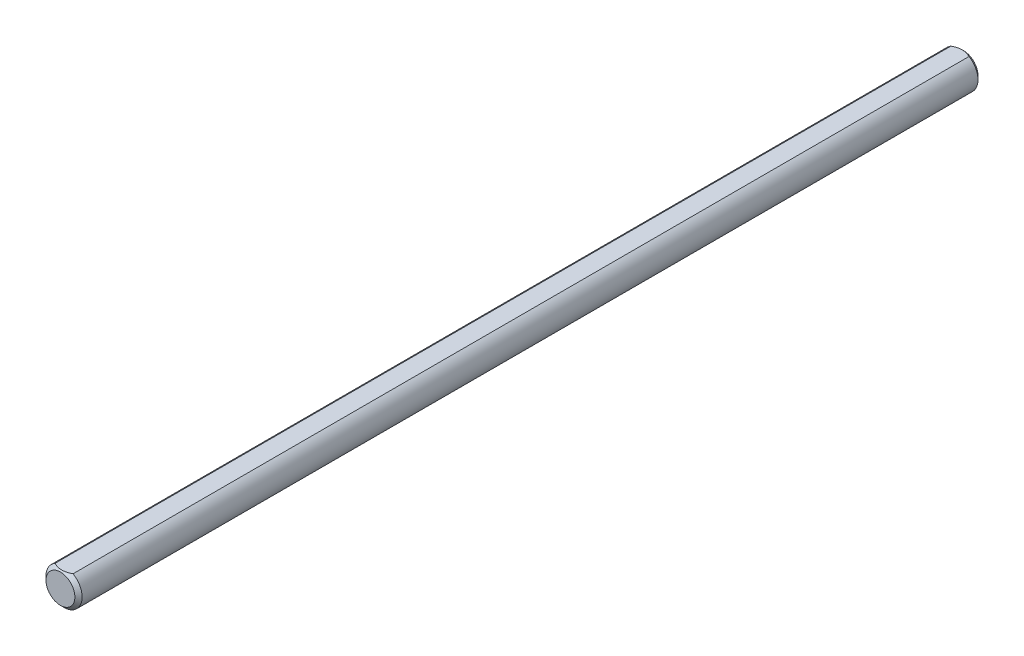
ISO-10303-21;
HEADER;
FILE_DESCRIPTION(('STEP AP214'),'2;1');
FILE_NAME('part.step','',(''),(''),'','','');
FILE_SCHEMA(('AUTOMOTIVE_DESIGN { 1 0 10303 214 1 1 1 1 }'));
ENDSEC;
DATA;
#1=APPLICATION_CONTEXT('core data for automotive mechanical design processes');
#2=APPLICATION_PROTOCOL_DEFINITION('international standard','automotive_design',2000,#1);
#3=PRODUCT_CONTEXT('',#1,'mechanical');
#4=PRODUCT('Part','Part','',(#3));
#5=PRODUCT_RELATED_PRODUCT_CATEGORY('part','',(#4));
#6=PRODUCT_DEFINITION_FORMATION('','',#4);
#7=PRODUCT_DEFINITION_CONTEXT('part definition',#1,'design');
#8=PRODUCT_DEFINITION('design','',#6,#7);
#9=PRODUCT_DEFINITION_SHAPE('','',#8);
#10=(LENGTH_UNIT() NAMED_UNIT(*) SI_UNIT(.MILLI.,.METRE.));
#11=(NAMED_UNIT(*) PLANE_ANGLE_UNIT() SI_UNIT($,.RADIAN.));
#12=(NAMED_UNIT(*) SI_UNIT($,.STERADIAN.) SOLID_ANGLE_UNIT());
#13=UNCERTAINTY_MEASURE_WITH_UNIT(LENGTH_MEASURE(1.E-05),#10,'distance_accuracy_value','');
#14=(GEOMETRIC_REPRESENTATION_CONTEXT(3) GLOBAL_UNCERTAINTY_ASSIGNED_CONTEXT((#13)) GLOBAL_UNIT_ASSIGNED_CONTEXT((#10,
#11,#12)) REPRESENTATION_CONTEXT('',''));
#15=CARTESIAN_POINT('',(0.,0.,0.));
#16=DIRECTION('',(0.,0.,1.));
#17=DIRECTION('',(1.,0.,0.));
#18=AXIS2_PLACEMENT_3D('',#15,#16,#17);
#19=CARTESIAN_POINT('',(0.,0.,79.375));
#20=DIRECTION('',(0.,0.,-1.00000000000002));
#21=DIRECTION('',(-1.,0.,0.));
#22=AXIS2_PLACEMENT_3D('',#19,#20,#21);
#23=CYLINDRICAL_SURFACE('',#22,3.175);
#24=CARTESIAN_POINT('',(0.,-1.52655665885959E-13,78.7400000000001));
#25=DIRECTION('',(0.,0.,1.00000000000002));
#26=DIRECTION('',(1.,0.,0.));
#27=AXIS2_PLACEMENT_3D('',#24,#25,#26);
#28=CIRCLE('',#27,3.175);
#29=CARTESIAN_POINT('',(1.58749999999999,2.7496306570157,78.7400000000002));
#30=VERTEX_POINT('',#29);
#31=CARTESIAN_POINT('',(-1.58750000000006,2.74963065701568,78.7400000000001));
#32=VERTEX_POINT('',#31);
#33=EDGE_CURVE('E75',#30,#32,#28,.F.);
#34=ORIENTED_EDGE('',*,*,#33,.T.);
#35=DIRECTION('',(0.,0.,1.00000000000002));
#36=VECTOR('',#35,1.);
#37=CARTESIAN_POINT('',(-1.5875000000003,2.74963065701568,-79.3750000000017));
#38=LINE('',#37,#36);
#39=CARTESIAN_POINT('',(-1.58750000000013,2.74963065701566,-78.7400000000014));
#40=VERTEX_POINT('',#39);
#41=EDGE_CURVE('E53',#40,#32,#38,.T.);
#42=ORIENTED_EDGE('',*,*,#41,.F.);
#43=CARTESIAN_POINT('',(-2.22044604925031E-13,-1.31838984174237E-13,-78.7400000000021));
#44=DIRECTION('',(0.,0.,1.00000000000002));
#45=DIRECTION('',(1.,0.,0.));
#46=AXIS2_PLACEMENT_3D('',#43,#44,#45);
#47=CIRCLE('',#46,3.175);
#48=CARTESIAN_POINT('',(1.58749999999981,2.74963065701566,-78.7400000000016));
#49=VERTEX_POINT('',#48);
#50=EDGE_CURVE('E74',#40,#49,#47,.T.);
#51=ORIENTED_EDGE('',*,*,#50,.T.);
#52=DIRECTION('',(0.,0.,1.00000000000002));
#53=VECTOR('',#52,1.);
#54=CARTESIAN_POINT('',(1.58749999999971,2.74963065701565,-79.3750000000016));
#55=LINE('',#54,#53);
#56=EDGE_CURVE('E63',#49,#30,#55,.T.);
#57=ORIENTED_EDGE('',*,*,#56,.T.);
#58=EDGE_LOOP('',(#34,#42,#51,#57));
#59=FACE_BOUND('',#58,.T.);
#60=ADVANCED_FACE('F34',(#59),#23,.T.);
#61=CARTESIAN_POINT('',(0.,0.,79.375));
#62=DIRECTION('',(0.,0.,1.00000000000002));
#63=DIRECTION('',(1.,0.,0.));
#64=AXIS2_PLACEMENT_3D('',#61,#62,#63);
#65=PLANE('',#64);
#66=CARTESIAN_POINT('',(0.,0.,79.375));
#67=DIRECTION('',(0.,0.,1.00000000000002));
#68=DIRECTION('',(1.,0.,0.));
#69=AXIS2_PLACEMENT_3D('',#66,#67,#68);
#70=CIRCLE('',#69,2.5400000000001);
#71=CARTESIAN_POINT('',(2.54000000000009,0.,79.375));
#72=VERTEX_POINT('',#71);
#73=EDGE_CURVE('E47',#72,#72,#70,.T.);
#74=ORIENTED_EDGE('',*,*,#73,.T.);
#75=EDGE_LOOP('',(#74));
#76=FACE_BOUND('',#75,.T.);
#77=ADVANCED_FACE('F85',(#76),#65,.T.);
#78=CARTESIAN_POINT('',(-3.53883589099269E-13,-1.2490009027033E-13,-79.3750000000022));
#79=DIRECTION('',(0.,0.,1.00000000000002));
#80=DIRECTION('',(1.,0.,0.));
#81=AXIS2_PLACEMENT_3D('',#78,#79,#80);
#82=PLANE('',#81);
#83=CARTESIAN_POINT('',(-3.53883589099269E-13,-1.2490009027033E-13,-79.3750000000022));
#84=DIRECTION('',(0.,0.,1.00000000000002));
#85=DIRECTION('',(1.,0.,0.));
#86=AXIS2_PLACEMENT_3D('',#83,#84,#85);
#87=CIRCLE('',#86,2.53999999999983);
#88=CARTESIAN_POINT('',(2.53999999999949,-1.2870704502177E-13,-79.3750000000022));
#89=VERTEX_POINT('',#88);
#90=EDGE_CURVE('E77',#89,#89,#87,.F.);
#91=ORIENTED_EDGE('',*,*,#90,.T.);
#92=EDGE_LOOP('',(#91));
#93=FACE_BOUND('',#92,.T.);
#94=ADVANCED_FACE('F93',(#93),#82,.F.);
#95=CARTESIAN_POINT('',(-2.22044604925031E-13,-1.31838984174237E-13,-78.7400000000021));
#96=DIRECTION('',(0.,0.,1.00000000000002));
#97=DIRECTION('',(1.,0.,0.));
#98=AXIS2_PLACEMENT_3D('',#95,#96,#97);
#99=CONICAL_SURFACE('',#98,3.175,0.785398163397452);
#100=CARTESIAN_POINT('',(-3.22896135223756,2.74963065701563,-77.6739317189854));
#101=CARTESIAN_POINT('',(-3.1506164955014,2.74963065701566,-77.7335665245478));
#102=CARTESIAN_POINT('',(-3.07184009651301,2.74963065701567,-77.7926434820269));
#103=CARTESIAN_POINT('',(-2.91325130568855,2.74963065701568,-77.9094297176203));
#104=CARTESIAN_POINT('',(-2.83343866506327,2.74963065701568,-77.9671386575277));
#105=CARTESIAN_POINT('',(-2.67202062852775,2.74963065701568,-78.081347547807));
#106=CARTESIAN_POINT('',(-2.59040613970458,2.74963065701568,-78.1378346895391));
#107=CARTESIAN_POINT('',(-2.42580311622192,2.74963065701568,-78.2487635143363));
#108=CARTESIAN_POINT('',(-2.34281467809363,2.74963065701568,-78.3032053402304));
#109=CARTESIAN_POINT('',(-2.17021447787258,2.74963065701568,-78.4127738711676));
#110=CARTESIAN_POINT('',(-2.08050398524223,2.74963065701568,-78.4677458353421));
#111=CARTESIAN_POINT('',(-1.89900904678723,2.74963065701568,-78.5741469931997));
#112=CARTESIAN_POINT('',(-1.80722487525667,2.74963065701568,-78.6255766518368));
#113=CARTESIAN_POINT('',(-1.62153760368964,2.74963065701568,-78.7238148050533));
#114=CARTESIAN_POINT('',(-1.5276414092253,2.7496306570157,-78.7706362501786));
#115=CARTESIAN_POINT('',(-1.3372470657213,2.74963065701566,-78.8586008153425));
#116=CARTESIAN_POINT('',(-1.24075014112732,2.74963065701562,-78.8997465535959));
#117=CARTESIAN_POINT('',(-1.05364742760771,2.74963065701563,-78.9715564372322));
#118=CARTESIAN_POINT('',(-0.963276425588905,2.74963065701567,-79.0028260439751));
#119=CARTESIAN_POINT('',(-0.780303735161403,2.74963065701569,-79.0581231873524));
#120=CARTESIAN_POINT('',(-0.687701898779755,2.74963065701567,-79.0821502421465));
#121=CARTESIAN_POINT('',(-0.502391431283144,2.7496306570157,-79.121288290843));
#122=CARTESIAN_POINT('',(-0.409716445147053,2.74963065701574,-79.1365559547509));
#123=CARTESIAN_POINT('',(-0.223306330685539,2.74963065701562,-79.1578688420312));
#124=CARTESIAN_POINT('',(-0.12957140343761,2.74963065701545,-79.1639157860156));
#125=CARTESIAN_POINT('',(0.0543357559014877,2.74963065701546,-79.1663094852499));
#126=CARTESIAN_POINT('',(0.1445032425522,2.74963065701563,-79.1630280862296));
#127=CARTESIAN_POINT('',(0.324095543573265,2.74963065701574,-79.1477817719658));
#128=CARTESIAN_POINT('',(0.413520286896717,2.74963065701569,-79.1358160354833));
#129=CARTESIAN_POINT('',(0.592496066023927,2.74963065701567,-79.103661523538));
#130=CARTESIAN_POINT('',(0.68202117737888,2.7496306570157,-79.0833305801771));
#131=CARTESIAN_POINT('',(0.859103373963658,2.74963065701567,-79.0355451979558));
#132=CARTESIAN_POINT('',(0.946660601088583,2.74963065701561,-79.0080912745029));
#133=CARTESIAN_POINT('',(1.21954622680441,2.74963065701553,-78.9121294821912));
#134=CARTESIAN_POINT('',(1.40108594012656,2.74963065701566,-78.8328094527381));
#135=CARTESIAN_POINT('',(1.66675889489854,2.7496306570157,-78.7005539852276));
#136=CARTESIAN_POINT('',(1.7543748838501,2.74963065701569,-78.6541526611257));
#137=CARTESIAN_POINT('',(1.92761951465592,2.74963065701568,-78.5577692377695));
#138=CARTESIAN_POINT('',(2.01324850705448,2.74963065701569,-78.5077877765774));
#139=CARTESIAN_POINT('',(2.17855184285728,2.74963065701569,-78.407513843308));
#140=CARTESIAN_POINT('',(2.25831097248794,2.74963065701569,-78.3573595590415));
#141=CARTESIAN_POINT('',(2.41646118639991,2.74963065701569,-78.2549282177644));
#142=CARTESIAN_POINT('',(2.49485216688172,2.74963065701569,-78.2026510006824));
#143=CARTESIAN_POINT('',(2.64980987258627,2.74963065701569,-78.0967831250573));
#144=CARTESIAN_POINT('',(2.72638621983961,2.74963065701569,-78.0432064917757));
#145=CARTESIAN_POINT('',(2.87849044969169,2.74963065701568,-77.9346270900187));
#146=CARTESIAN_POINT('',(2.9540186151926,2.74963065701567,-77.8796247183107));
#147=CARTESIAN_POINT('',(3.02910770969609,2.74963065701563,-77.824038955584));
#148=B_SPLINE_CURVE_WITH_KNOTS('',3,(#100,#101,#102,#103,#104,#105,#106,#107,#108,#109,#110,
#111,#112,#113,#114,#115,#116,#117,#118,#119,#120,#121,#122,#123,#124,#125,#126,#127,#128,#129,
#130,#131,#132,#133,#134,#135,#136,#137,#138,#139,#140,#141,#142,#143,#144,#145,#146,#147),
.UNSPECIFIED.,.F.,.F.,(4,2,2,2,2,2,2,2,2,2,2,2,2,2,2,2,2,2,2,2,2,2,2,4),(0.,0.295383449271288,
0.590839178498932,0.888580871623109,1.18630173399086,1.50187785569768,1.81741247644355,
2.1320333829483,2.44650866534186,2.73314264689648,3.01979569373843,3.30114758261635,
3.58244696402042,3.85269226293515,4.12296312107209,4.39803055604419,4.67307809311895,
5.2655707124134,5.56297998480406,5.86033638333491,6.14295523590904,6.42559543796951,
6.70595195130154,6.98623126477309),.UNSPECIFIED.);
#149=EDGE_CURVE('E58',#49,#40,#148,.F.);
#150=ORIENTED_EDGE('',*,*,#149,.F.);
#151=ORIENTED_EDGE('',*,*,#50,.F.);
#152=EDGE_LOOP('',(#150,#151));
#153=FACE_BOUND('',#152,.T.);
#154=ORIENTED_EDGE('',*,*,#90,.F.);
#155=EDGE_LOOP('',(#154));
#156=FACE_BOUND('',#155,.T.);
#157=ADVANCED_FACE('F72',(#153,#156),#99,.T.);
#158=CARTESIAN_POINT('',(0.,0.,79.375));
#159=DIRECTION('',(0.,0.,-1.00000000000002));
#160=DIRECTION('',(-1.,0.,0.));
#161=AXIS2_PLACEMENT_3D('',#158,#159,#160);
#162=CONICAL_SURFACE('',#161,2.5400000000001,0.785398163397452);
#163=CARTESIAN_POINT('',(-3.22896135223753,2.74963065701556,77.673931718984));
#164=CARTESIAN_POINT('',(-3.15061649550119,2.74963065701562,77.7335665245461));
#165=CARTESIAN_POINT('',(-3.07184009651274,2.74963065701565,77.792643482025));
#166=CARTESIAN_POINT('',(-2.91325130568827,2.74963065701567,77.9094297176183));
#167=CARTESIAN_POINT('',(-2.83343866506304,2.74963065701566,77.9671386575258));
#168=CARTESIAN_POINT('',(-2.67202062852755,2.74963065701566,78.0813475478051));
#169=CARTESIAN_POINT('',(-2.59040613970437,2.74963065701566,78.1378346895372));
#170=CARTESIAN_POINT('',(-2.4258031162217,2.74963065701566,78.2487635143344));
#171=CARTESIAN_POINT('',(-2.34281467809341,2.74963065701566,78.3032053402285));
#172=CARTESIAN_POINT('',(-2.17021447787234,2.74963065701566,78.4127738711657));
#173=CARTESIAN_POINT('',(-2.08050398524197,2.74963065701566,78.4677458353402));
#174=CARTESIAN_POINT('',(-1.89900904678694,2.74963065701566,78.5741469931979));
#175=CARTESIAN_POINT('',(-1.80722487525638,2.74963065701566,78.6255766518349));
#176=CARTESIAN_POINT('',(-1.62153760368932,2.74963065701566,78.7238148050514));
#177=CARTESIAN_POINT('',(-1.52764140922495,2.74963065701564,78.7706362501767));
#178=CARTESIAN_POINT('',(-1.33724706572103,2.74963065701568,78.8586008153407));
#179=CARTESIAN_POINT('',(-1.24075014112713,2.74963065701572,78.8997465535943));
#180=CARTESIAN_POINT('',(-1.05364742760754,2.74963065701571,78.9715564372306));
#181=CARTESIAN_POINT('',(-0.963276425588676,2.74963065701568,79.0028260439733));
#182=CARTESIAN_POINT('',(-0.780303735161123,2.74963065701565,79.0581231873505));
#183=CARTESIAN_POINT('',(-0.687701898779481,2.74963065701565,79.0821502421446));
#184=CARTESIAN_POINT('',(-0.502391431282863,2.74963065701567,79.1212882908411));
#185=CARTESIAN_POINT('',(-0.40971644514676,2.74963065701568,79.1365559547489));
#186=CARTESIAN_POINT('',(-0.22330633068527,2.74963065701564,79.1578688420294));
#187=CARTESIAN_POINT('',(-0.129571403437377,2.7496306570156,79.1639157860143));
#188=CARTESIAN_POINT('',(0.0543357559016232,2.7496306570156,79.1663094852486));
#189=CARTESIAN_POINT('',(0.144503242552274,2.74963065701565,79.1630280862279));
#190=CARTESIAN_POINT('',(0.324095543573254,2.74963065701568,79.1477817719638));
#191=CARTESIAN_POINT('',(0.413520286896682,2.74963065701566,79.1358160354815));
#192=CARTESIAN_POINT('',(0.592496066023822,2.74963065701567,79.1036615235362));
#193=CARTESIAN_POINT('',(0.682021177378727,2.74963065701571,79.0833305801752));
#194=CARTESIAN_POINT('',(0.859103373963496,2.74963065701562,79.0355451979541));
#195=CARTESIAN_POINT('',(0.946660601088459,2.7496306570155,79.0080912745016));
#196=CARTESIAN_POINT('',(1.21954622680433,2.74963065701536,78.9121294821902));
#197=CARTESIAN_POINT('',(1.40108594012629,2.74963065701561,78.8328094527366));
#198=CARTESIAN_POINT('',(1.66675889489824,2.74963065701569,78.7005539852259));
#199=CARTESIAN_POINT('',(1.75437488384983,2.74963065701567,78.654152661124));
#200=CARTESIAN_POINT('',(1.92761951465571,2.74963065701566,78.5577692377679));
#201=CARTESIAN_POINT('',(2.01324850705429,2.74963065701566,78.5077877765758));
#202=CARTESIAN_POINT('',(2.17855184285712,2.74963065701567,78.4075138433063));
#203=CARTESIAN_POINT('',(2.25831097248779,2.74963065701567,78.3573595590398));
#204=CARTESIAN_POINT('',(2.41646118639979,2.74963065701567,78.2549282177627));
#205=CARTESIAN_POINT('',(2.49485216688163,2.74963065701566,78.2026510006807));
#206=CARTESIAN_POINT('',(2.64980987258617,2.74963065701567,78.0967831250556));
#207=CARTESIAN_POINT('',(2.72638621983947,2.74963065701568,78.043206491774));
#208=CARTESIAN_POINT('',(2.87849044969158,2.74963065701566,77.934627090017));
#209=CARTESIAN_POINT('',(2.95401861519255,2.74963065701563,77.8796247183092));
#210=CARTESIAN_POINT('',(3.02910770969622,2.74963065701556,77.8240389555828));
#211=B_SPLINE_CURVE_WITH_KNOTS('',3,(#163,#164,#165,#166,#167,#168,#169,#170,#171,#172,#173,
#174,#175,#176,#177,#178,#179,#180,#181,#182,#183,#184,#185,#186,#187,#188,#189,#190,#191,#192,
#193,#194,#195,#196,#197,#198,#199,#200,#201,#202,#203,#204,#205,#206,#207,#208,#209,#210),
.UNSPECIFIED.,.F.,.F.,(4,2,2,2,2,2,2,2,2,2,2,2,2,2,2,2,2,2,2,2,2,2,2,4),(0.,0.295383449271194,
0.590839178498776,0.888580871622957,1.18630173399073,1.5018778556976,1.81741247644352,
2.13203338294827,2.4465086653418,2.7331426468964,3.01979569373839,3.30114758261632,
3.58244696402033,3.85269226293489,4.12296312107175,4.39803055604375,4.67307809311837,
5.26557071241281,5.56297998480355,5.86033638333445,6.14295523590863,6.42559543796916,
6.70595195130113,6.9862312647726),.UNSPECIFIED.);
#212=EDGE_CURVE('E11',#32,#30,#211,.T.);
#213=ORIENTED_EDGE('',*,*,#212,.F.);
#214=ORIENTED_EDGE('',*,*,#33,.F.);
#215=EDGE_LOOP('',(#213,#214));
#216=FACE_BOUND('',#215,.T.);
#217=ORIENTED_EDGE('',*,*,#73,.F.);
#218=EDGE_LOOP('',(#217));
#219=FACE_BOUND('',#218,.T.);
#220=ADVANCED_FACE('F36',(#216,#219),#162,.T.);
#221=CARTESIAN_POINT('',(-1.5875000000003,2.74963065701568,-79.3750000000017));
#222=DIRECTION('',(0.,-1.00000000000001,0.));
#223=DIRECTION('',(0.,0.,-1.00000000000002));
#224=AXIS2_PLACEMENT_3D('',#221,#222,#223);
#225=PLANE('',#224);
#226=ORIENTED_EDGE('',*,*,#149,.T.);
#227=ORIENTED_EDGE('',*,*,#41,.T.);
#228=ORIENTED_EDGE('',*,*,#212,.T.);
#229=ORIENTED_EDGE('',*,*,#56,.F.);
#230=EDGE_LOOP('',(#226,#227,#228,#229));
#231=FACE_BOUND('',#230,.T.);
#232=ADVANCED_FACE('F64',(#231),#225,.F.);
#233=CLOSED_SHELL('',(#60,#77,#94,#157,#220,#232));
#234=MANIFOLD_SOLID_BREP('B2',#233);
#235=ADVANCED_BREP_SHAPE_REPRESENTATION('',(#18,#234),#14);
#236=SHAPE_DEFINITION_REPRESENTATION(#9,#235);
ENDSEC;
END-ISO-10303-21;
